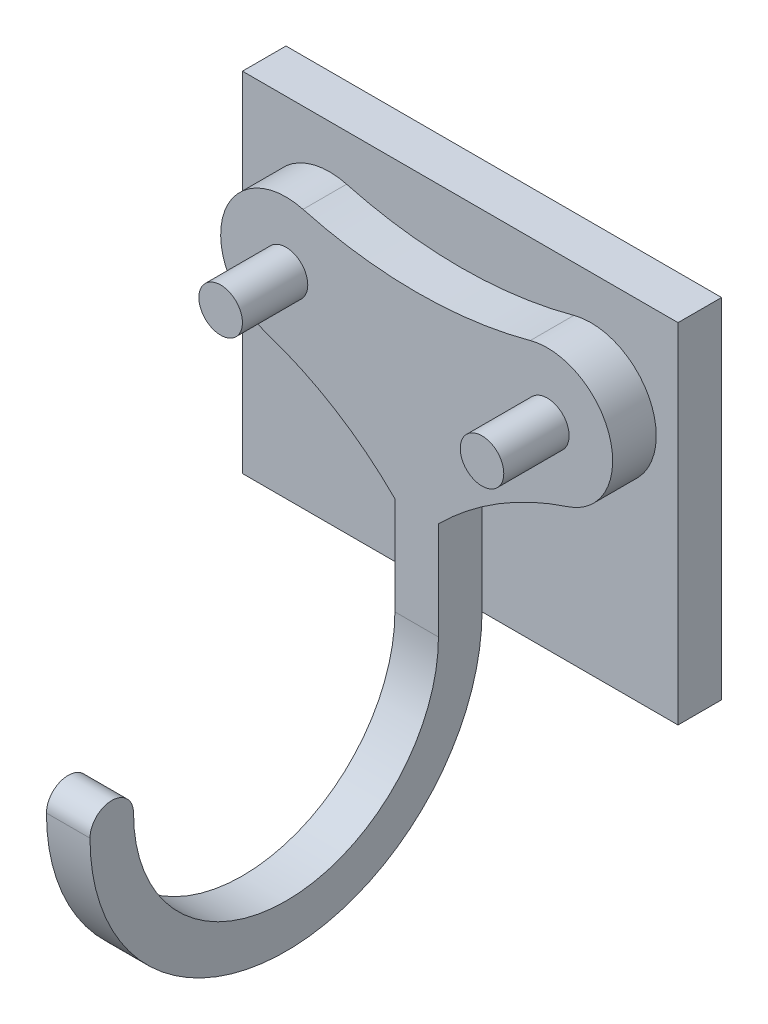
ISO-10303-21;
HEADER;
FILE_DESCRIPTION(('STEP AP214'),'2;1');
FILE_NAME('part.step','',(''),(''),'','','');
FILE_SCHEMA(('AUTOMOTIVE_DESIGN { 1 0 10303 214 1 1 1 1 }'));
ENDSEC;
DATA;
#1=APPLICATION_CONTEXT('core data for automotive mechanical design processes');
#2=APPLICATION_PROTOCOL_DEFINITION('international standard','automotive_design',2000,#1);
#3=PRODUCT_CONTEXT('',#1,'mechanical');
#4=PRODUCT('Part','Part','',(#3));
#5=PRODUCT_RELATED_PRODUCT_CATEGORY('part','',(#4));
#6=PRODUCT_DEFINITION_FORMATION('','',#4);
#7=PRODUCT_DEFINITION_CONTEXT('part definition',#1,'design');
#8=PRODUCT_DEFINITION('design','',#6,#7);
#9=PRODUCT_DEFINITION_SHAPE('','',#8);
#10=(LENGTH_UNIT() NAMED_UNIT(*) SI_UNIT(.MILLI.,.METRE.));
#11=(NAMED_UNIT(*) PLANE_ANGLE_UNIT() SI_UNIT($,.RADIAN.));
#12=(NAMED_UNIT(*) SI_UNIT($,.STERADIAN.) SOLID_ANGLE_UNIT());
#13=UNCERTAINTY_MEASURE_WITH_UNIT(LENGTH_MEASURE(1.E-05),#10,'distance_accuracy_value','');
#14=(GEOMETRIC_REPRESENTATION_CONTEXT(3) GLOBAL_UNCERTAINTY_ASSIGNED_CONTEXT((#13)) GLOBAL_UNIT_ASSIGNED_CONTEXT((#10,
#11,#12)) REPRESENTATION_CONTEXT('',''));
#15=CARTESIAN_POINT('',(0.,0.,0.));
#16=DIRECTION('',(0.,0.,1.));
#17=DIRECTION('',(1.,0.,0.));
#18=AXIS2_PLACEMENT_3D('',#15,#16,#17);
#19=CARTESIAN_POINT('',(-10.,8.,2.));
#20=DIRECTION('',(1.,0.,0.));
#21=DIRECTION('',(0.,0.,-1.));
#22=AXIS2_PLACEMENT_3D('',#19,#20,#21);
#23=PLANE('',#22);
#24=DIRECTION('',(0.,-1.,0.));
#25=VECTOR('',#24,1.);
#26=CARTESIAN_POINT('',(-10.,8.,0.));
#27=LINE('',#26,#25);
#28=CARTESIAN_POINT('',(-10.,8.,0.));
#29=VERTEX_POINT('',#28);
#30=CARTESIAN_POINT('',(-10.,-8.,0.));
#31=VERTEX_POINT('',#30);
#32=EDGE_CURVE('E279',#29,#31,#27,.T.);
#33=ORIENTED_EDGE('',*,*,#32,.T.);
#34=DIRECTION('',(0.,0.,-1.));
#35=VECTOR('',#34,1.);
#36=CARTESIAN_POINT('',(-10.,-8.,2.));
#37=LINE('',#36,#35);
#38=CARTESIAN_POINT('',(-10.,-8.,2.));
#39=VERTEX_POINT('',#38);
#40=EDGE_CURVE('E11',#39,#31,#37,.T.);
#41=ORIENTED_EDGE('',*,*,#40,.F.);
#42=DIRECTION('',(0.,-1.,0.));
#43=VECTOR('',#42,1.);
#44=CARTESIAN_POINT('',(-10.,8.,2.));
#45=LINE('',#44,#43);
#46=CARTESIAN_POINT('',(-10.,8.,2.));
#47=VERTEX_POINT('',#46);
#48=EDGE_CURVE('E280',#47,#39,#45,.T.);
#49=ORIENTED_EDGE('',*,*,#48,.F.);
#50=DIRECTION('',(0.,0.,-1.));
#51=VECTOR('',#50,1.);
#52=CARTESIAN_POINT('',(-10.,8.,2.));
#53=LINE('',#52,#51);
#54=EDGE_CURVE('E298',#47,#29,#53,.T.);
#55=ORIENTED_EDGE('',*,*,#54,.T.);
#56=EDGE_LOOP('',(#33,#41,#49,#55));
#57=FACE_BOUND('',#56,.T.);
#58=ADVANCED_FACE('F45',(#57),#23,.F.);
#59=CARTESIAN_POINT('',(-10.,-8.,2.));
#60=DIRECTION('',(0.,1.,0.));
#61=DIRECTION('',(0.,0.,1.));
#62=AXIS2_PLACEMENT_3D('',#59,#60,#61);
#63=PLANE('',#62);
#64=DIRECTION('',(1.,0.,0.));
#65=VECTOR('',#64,1.);
#66=CARTESIAN_POINT('',(-10.,-8.,2.));
#67=LINE('',#66,#65);
#68=CARTESIAN_POINT('',(1.,-8.,2.));
#69=VERTEX_POINT('',#68);
#70=CARTESIAN_POINT('',(10.,-8.,2.));
#71=VERTEX_POINT('',#70);
#72=EDGE_CURVE('E284',#69,#71,#67,.T.);
#73=ORIENTED_EDGE('',*,*,#72,.F.);
#74=DIRECTION('',(-1.,0.,0.));
#75=VECTOR('',#74,1.);
#76=CARTESIAN_POINT('',(1.,-8.,2.));
#77=LINE('',#76,#75);
#78=CARTESIAN_POINT('',(-1.,-8.,2.));
#79=VERTEX_POINT('',#78);
#80=EDGE_CURVE('E156',#69,#79,#77,.T.);
#81=ORIENTED_EDGE('',*,*,#80,.T.);
#82=EDGE_CURVE('E286',#39,#79,#67,.T.);
#83=ORIENTED_EDGE('',*,*,#82,.F.);
#84=ORIENTED_EDGE('',*,*,#40,.T.);
#85=DIRECTION('',(1.,0.,0.));
#86=VECTOR('',#85,1.);
#87=CARTESIAN_POINT('',(-10.,-8.,0.));
#88=LINE('',#87,#86);
#89=CARTESIAN_POINT('',(10.,-8.,0.));
#90=VERTEX_POINT('',#89);
#91=EDGE_CURVE('E302',#31,#90,#88,.T.);
#92=ORIENTED_EDGE('',*,*,#91,.T.);
#93=DIRECTION('',(0.,0.,-1.));
#94=VECTOR('',#93,1.);
#95=CARTESIAN_POINT('',(10.,-8.,2.));
#96=LINE('',#95,#94);
#97=EDGE_CURVE('E53',#71,#90,#96,.T.);
#98=ORIENTED_EDGE('',*,*,#97,.F.);
#99=EDGE_LOOP('',(#73,#81,#83,#84,#92,#98));
#100=FACE_BOUND('',#99,.T.);
#101=ADVANCED_FACE('F325',(#100),#63,.F.);
#102=CARTESIAN_POINT('',(10.,8.,2.));
#103=DIRECTION('',(1.,0.,0.));
#104=DIRECTION('',(0.,1.,0.));
#105=AXIS2_PLACEMENT_3D('',#102,#103,#104);
#106=PLANE('',#105);
#107=DIRECTION('',(0.,-1.,0.));
#108=VECTOR('',#107,1.);
#109=CARTESIAN_POINT('',(10.,8.,0.));
#110=LINE('',#109,#108);
#111=CARTESIAN_POINT('',(10.,8.,0.));
#112=VERTEX_POINT('',#111);
#113=EDGE_CURVE('E306',#112,#90,#110,.T.);
#114=ORIENTED_EDGE('',*,*,#113,.F.);
#115=DIRECTION('',(0.,0.,-1.));
#116=VECTOR('',#115,1.);
#117=CARTESIAN_POINT('',(10.,8.,2.));
#118=LINE('',#117,#116);
#119=CARTESIAN_POINT('',(10.,8.,2.));
#120=VERTEX_POINT('',#119);
#121=EDGE_CURVE('E315',#120,#112,#118,.T.);
#122=ORIENTED_EDGE('',*,*,#121,.F.);
#123=DIRECTION('',(0.,-1.,0.));
#124=VECTOR('',#123,1.);
#125=CARTESIAN_POINT('',(10.,8.,2.));
#126=LINE('',#125,#124);
#127=EDGE_CURVE('E290',#120,#71,#126,.T.);
#128=ORIENTED_EDGE('',*,*,#127,.T.);
#129=ORIENTED_EDGE('',*,*,#97,.T.);
#130=EDGE_LOOP('',(#114,#122,#128,#129));
#131=FACE_BOUND('',#130,.T.);
#132=ADVANCED_FACE('F321',(#131),#106,.T.);
#133=CARTESIAN_POINT('',(-10.,8.,2.));
#134=DIRECTION('',(0.,1.,0.));
#135=DIRECTION('',(0.,0.,1.));
#136=AXIS2_PLACEMENT_3D('',#133,#134,#135);
#137=PLANE('',#136);
#138=DIRECTION('',(1.,0.,0.));
#139=VECTOR('',#138,1.);
#140=CARTESIAN_POINT('',(-10.,8.,0.));
#141=LINE('',#140,#139);
#142=EDGE_CURVE('E285',#29,#112,#141,.T.);
#143=ORIENTED_EDGE('',*,*,#142,.F.);
#144=ORIENTED_EDGE('',*,*,#54,.F.);
#145=DIRECTION('',(1.,0.,0.));
#146=VECTOR('',#145,1.);
#147=CARTESIAN_POINT('',(-10.,8.,2.));
#148=LINE('',#147,#146);
#149=EDGE_CURVE('E294',#47,#120,#148,.T.);
#150=ORIENTED_EDGE('',*,*,#149,.T.);
#151=ORIENTED_EDGE('',*,*,#121,.T.);
#152=EDGE_LOOP('',(#143,#144,#150,#151));
#153=FACE_BOUND('',#152,.T.);
#154=ADVANCED_FACE('F332',(#153),#137,.T.);
#155=CARTESIAN_POINT('',(0.,0.,2.));
#156=DIRECTION('',(0.,0.,1.));
#157=DIRECTION('',(1.,0.,0.));
#158=AXIS2_PLACEMENT_3D('',#155,#156,#157);
#159=PLANE('',#158);
#160=DIRECTION('',(0.,1.,0.));
#161=VECTOR('',#160,1.);
#162=CARTESIAN_POINT('',(1.,-3.5,2.));
#163=LINE('',#162,#161);
#164=CARTESIAN_POINT('',(1.,-3.5,2.));
#165=VERTEX_POINT('',#164);
#166=EDGE_CURVE('E249',#69,#165,#163,.T.);
#167=ORIENTED_EDGE('',*,*,#166,.F.);
#168=ORIENTED_EDGE('',*,*,#72,.T.);
#169=ORIENTED_EDGE('',*,*,#127,.F.);
#170=ORIENTED_EDGE('',*,*,#149,.F.);
#171=ORIENTED_EDGE('',*,*,#48,.T.);
#172=ORIENTED_EDGE('',*,*,#82,.T.);
#173=DIRECTION('',(0.,-1.,0.));
#174=VECTOR('',#173,1.);
#175=CARTESIAN_POINT('',(-1.,-3.5,2.));
#176=LINE('',#175,#174);
#177=CARTESIAN_POINT('',(-1.,-3.5,2.));
#178=VERTEX_POINT('',#177);
#179=EDGE_CURVE('E245',#178,#79,#176,.T.);
#180=ORIENTED_EDGE('',*,*,#179,.F.);
#181=CARTESIAN_POINT('',(-11.6096362336248,-14.1035663335576,2.));
#182=DIRECTION('',(0.,0.,-1.));
#183=DIRECTION('',(1.,0.,0.));
#184=AXIS2_PLACEMENT_3D('',#181,#182,#183);
#185=CIRCLE('',#184,15.);
#186=CARTESIAN_POINT('',(-6.93493937227081,0.149405611073742,2.));
#187=VERTEX_POINT('',#186);
#188=EDGE_CURVE('E241',#187,#178,#185,.T.);
#189=ORIENTED_EDGE('',*,*,#188,.F.);
#190=CARTESIAN_POINT('',(-6.,3.,2.));
#191=DIRECTION('',(0.,0.,1.));
#192=DIRECTION('',(1.,0.,0.));
#193=AXIS2_PLACEMENT_3D('',#190,#191,#192);
#194=CIRCLE('',#193,3.);
#195=CARTESIAN_POINT('',(-5.21739130434783,5.89612217102276,2.));
#196=VERTEX_POINT('',#195);
#197=EDGE_CURVE('E237',#196,#187,#194,.T.);
#198=ORIENTED_EDGE('',*,*,#197,.F.);
#199=CARTESIAN_POINT('',(0.,25.2036033111745,2.));
#200=DIRECTION('',(0.,0.,-1.));
#201=DIRECTION('',(1.,0.,0.));
#202=AXIS2_PLACEMENT_3D('',#199,#200,#201);
#203=CIRCLE('',#202,20.);
#204=CARTESIAN_POINT('',(5.21739130434783,5.89612217102276,2.));
#205=VERTEX_POINT('',#204);
#206=EDGE_CURVE('E196',#205,#196,#203,.T.);
#207=ORIENTED_EDGE('',*,*,#206,.F.);
#208=CARTESIAN_POINT('',(6.,3.,2.));
#209=DIRECTION('',(0.,0.,1.));
#210=DIRECTION('',(1.,0.,0.));
#211=AXIS2_PLACEMENT_3D('',#208,#209,#210);
#212=CIRCLE('',#211,3.);
#213=CARTESIAN_POINT('',(6.9349393722708,0.149405611073742,2.));
#214=VERTEX_POINT('',#213);
#215=EDGE_CURVE('E65',#214,#205,#212,.T.);
#216=ORIENTED_EDGE('',*,*,#215,.F.);
#217=CARTESIAN_POINT('',(11.6096362336248,-14.1035663335576,2.));
#218=DIRECTION('',(0.,0.,-1.));
#219=DIRECTION('',(1.,0.,0.));
#220=AXIS2_PLACEMENT_3D('',#217,#218,#219);
#221=CIRCLE('',#220,15.);
#222=EDGE_CURVE('E60',#165,#214,#221,.T.);
#223=ORIENTED_EDGE('',*,*,#222,.F.);
#224=EDGE_LOOP('',(#167,#168,#169,#170,#171,#172,#180,#189,#198,#207,#216,#223));
#225=FACE_BOUND('',#224,.T.);
#226=ADVANCED_FACE('F335',(#225),#159,.T.);
#227=CARTESIAN_POINT('',(0.,0.,0.));
#228=DIRECTION('',(0.,0.,1.));
#229=DIRECTION('',(1.,0.,0.));
#230=AXIS2_PLACEMENT_3D('',#227,#228,#229);
#231=PLANE('',#230);
#232=ORIENTED_EDGE('',*,*,#32,.F.);
#233=ORIENTED_EDGE('',*,*,#142,.T.);
#234=ORIENTED_EDGE('',*,*,#113,.T.);
#235=ORIENTED_EDGE('',*,*,#91,.F.);
#236=EDGE_LOOP('',(#232,#233,#234,#235));
#237=FACE_BOUND('',#236,.T.);
#238=ADVANCED_FACE('F329',(#237),#231,.F.);
#239=CARTESIAN_POINT('',(0.,25.2036033111745,4.));
#240=DIRECTION('',(0.,0.,-1.));
#241=DIRECTION('',(-1.,0.,0.));
#242=AXIS2_PLACEMENT_3D('',#239,#240,#241);
#243=CYLINDRICAL_SURFACE('',#242,20.);
#244=ORIENTED_EDGE('',*,*,#206,.T.);
#245=DIRECTION('',(0.,0.,-1.));
#246=VECTOR('',#245,1.);
#247=CARTESIAN_POINT('',(-5.21739130434783,5.89612217102276,4.));
#248=LINE('',#247,#246);
#249=CARTESIAN_POINT('',(-5.21739130434783,5.89612217102276,4.));
#250=VERTEX_POINT('',#249);
#251=EDGE_CURVE('E275',#250,#196,#248,.T.);
#252=ORIENTED_EDGE('',*,*,#251,.F.);
#253=CARTESIAN_POINT('',(0.,25.2036033111745,4.));
#254=DIRECTION('',(0.,0.,-1.));
#255=DIRECTION('',(1.,0.,0.));
#256=AXIS2_PLACEMENT_3D('',#253,#254,#255);
#257=CIRCLE('',#256,20.);
#258=CARTESIAN_POINT('',(5.21739130434783,5.89612217102276,4.));
#259=VERTEX_POINT('',#258);
#260=EDGE_CURVE('E208',#259,#250,#257,.T.);
#261=ORIENTED_EDGE('',*,*,#260,.F.);
#262=DIRECTION('',(0.,0.,-1.));
#263=VECTOR('',#262,1.);
#264=CARTESIAN_POINT('',(5.21739130434783,5.89612217102276,4.));
#265=LINE('',#264,#263);
#266=EDGE_CURVE('E233',#259,#205,#265,.T.);
#267=ORIENTED_EDGE('',*,*,#266,.T.);
#268=EDGE_LOOP('',(#244,#252,#261,#267));
#269=FACE_BOUND('',#268,.T.);
#270=ADVANCED_FACE('F351',(#269),#243,.F.);
#271=CARTESIAN_POINT('',(-6.,3.,4.));
#272=DIRECTION('',(0.,0.,-1.));
#273=DIRECTION('',(-1.,0.,0.));
#274=AXIS2_PLACEMENT_3D('',#271,#272,#273);
#275=CYLINDRICAL_SURFACE('',#274,3.);
#276=ORIENTED_EDGE('',*,*,#197,.T.);
#277=DIRECTION('',(0.,0.,-1.));
#278=VECTOR('',#277,1.);
#279=CARTESIAN_POINT('',(-6.93493937227081,0.149405611073742,4.));
#280=LINE('',#279,#278);
#281=CARTESIAN_POINT('',(-6.93493937227081,0.149405611073742,4.));
#282=VERTEX_POINT('',#281);
#283=EDGE_CURVE('E271',#282,#187,#280,.T.);
#284=ORIENTED_EDGE('',*,*,#283,.F.);
#285=CARTESIAN_POINT('',(-6.,3.,4.));
#286=DIRECTION('',(0.,0.,1.));
#287=DIRECTION('',(1.,0.,0.));
#288=AXIS2_PLACEMENT_3D('',#285,#286,#287);
#289=CIRCLE('',#288,3.);
#290=EDGE_CURVE('E212',#250,#282,#289,.T.);
#291=ORIENTED_EDGE('',*,*,#290,.F.);
#292=ORIENTED_EDGE('',*,*,#251,.T.);
#293=EDGE_LOOP('',(#276,#284,#291,#292));
#294=FACE_BOUND('',#293,.T.);
#295=ADVANCED_FACE('F347',(#294),#275,.T.);
#296=CARTESIAN_POINT('',(-11.6096362336248,-14.1035663335576,4.));
#297=DIRECTION('',(0.,0.,-1.));
#298=DIRECTION('',(-1.,0.,0.));
#299=AXIS2_PLACEMENT_3D('',#296,#297,#298);
#300=CYLINDRICAL_SURFACE('',#299,15.);
#301=ORIENTED_EDGE('',*,*,#188,.T.);
#302=DIRECTION('',(0.,0.,-1.));
#303=VECTOR('',#302,1.);
#304=CARTESIAN_POINT('',(-1.,-3.5,4.));
#305=LINE('',#304,#303);
#306=CARTESIAN_POINT('',(-1.,-3.5,4.));
#307=VERTEX_POINT('',#306);
#308=EDGE_CURVE('E267',#307,#178,#305,.T.);
#309=ORIENTED_EDGE('',*,*,#308,.F.);
#310=CARTESIAN_POINT('',(-11.6096362336248,-14.1035663335576,4.));
#311=DIRECTION('',(0.,0.,-1.));
#312=DIRECTION('',(1.,0.,0.));
#313=AXIS2_PLACEMENT_3D('',#310,#311,#312);
#314=CIRCLE('',#313,15.);
#315=EDGE_CURVE('E215',#282,#307,#314,.T.);
#316=ORIENTED_EDGE('',*,*,#315,.F.);
#317=ORIENTED_EDGE('',*,*,#283,.T.);
#318=EDGE_LOOP('',(#301,#309,#316,#317));
#319=FACE_BOUND('',#318,.T.);
#320=ADVANCED_FACE('F344',(#319),#300,.F.);
#321=CARTESIAN_POINT('',(-1.,-3.5,4.));
#322=DIRECTION('',(1.,0.,0.));
#323=DIRECTION('',(0.,1.,0.));
#324=AXIS2_PLACEMENT_3D('',#321,#322,#323);
#325=PLANE('',#324);
#326=ORIENTED_EDGE('',*,*,#179,.T.);
#327=CARTESIAN_POINT('',(-1.,-8.,11.));
#328=DIRECTION('',(-1.,0.,0.));
#329=DIRECTION('',(0.,-1.,0.));
#330=AXIS2_PLACEMENT_3D('',#327,#328,#329);
#331=CIRCLE('',#330,9.);
#332=CARTESIAN_POINT('',(-1.,-8.,20.));
#333=VERTEX_POINT('',#332);
#334=EDGE_CURVE('E173',#79,#333,#331,.T.);
#335=ORIENTED_EDGE('',*,*,#334,.T.);
#336=CARTESIAN_POINT('',(-1.,-8.,19.));
#337=DIRECTION('',(-1.,0.,0.));
#338=DIRECTION('',(0.,-1.,0.));
#339=AXIS2_PLACEMENT_3D('',#336,#337,#338);
#340=CIRCLE('',#339,1.);
#341=CARTESIAN_POINT('',(-1.,-8.,18.));
#342=VERTEX_POINT('',#341);
#343=EDGE_CURVE('E181',#333,#342,#340,.T.);
#344=ORIENTED_EDGE('',*,*,#343,.T.);
#345=CARTESIAN_POINT('',(-1.,-8.,11.));
#346=DIRECTION('',(1.,0.,0.));
#347=DIRECTION('',(0.,-1.,0.));
#348=AXIS2_PLACEMENT_3D('',#345,#346,#347);
#349=CIRCLE('',#348,7.);
#350=CARTESIAN_POINT('',(-1.,-8.,4.));
#351=VERTEX_POINT('',#350);
#352=EDGE_CURVE('E150',#342,#351,#349,.T.);
#353=ORIENTED_EDGE('',*,*,#352,.T.);
#354=DIRECTION('',(0.,-1.,0.));
#355=VECTOR('',#354,1.);
#356=CARTESIAN_POINT('',(-1.,-3.5,4.));
#357=LINE('',#356,#355);
#358=EDGE_CURVE('E218',#307,#351,#357,.T.);
#359=ORIENTED_EDGE('',*,*,#358,.F.);
#360=ORIENTED_EDGE('',*,*,#308,.T.);
#361=EDGE_LOOP('',(#326,#335,#344,#353,#359,#360));
#362=FACE_BOUND('',#361,.T.);
#363=ADVANCED_FACE('F339',(#362),#325,.F.);
#364=CARTESIAN_POINT('',(1.,-3.5,4.));
#365=DIRECTION('',(-1.,0.,0.));
#366=DIRECTION('',(0.,-1.,0.));
#367=AXIS2_PLACEMENT_3D('',#364,#365,#366);
#368=PLANE('',#367);
#369=ORIENTED_EDGE('',*,*,#166,.T.);
#370=DIRECTION('',(0.,0.,-1.));
#371=VECTOR('',#370,1.);
#372=CARTESIAN_POINT('',(1.,-3.5,4.));
#373=LINE('',#372,#371);
#374=CARTESIAN_POINT('',(1.,-3.5,4.));
#375=VERTEX_POINT('',#374);
#376=EDGE_CURVE('E263',#375,#165,#373,.T.);
#377=ORIENTED_EDGE('',*,*,#376,.F.);
#378=DIRECTION('',(0.,1.,0.));
#379=VECTOR('',#378,1.);
#380=CARTESIAN_POINT('',(1.,-3.5,4.));
#381=LINE('',#380,#379);
#382=CARTESIAN_POINT('',(1.,-8.,4.));
#383=VERTEX_POINT('',#382);
#384=EDGE_CURVE('E167',#383,#375,#381,.T.);
#385=ORIENTED_EDGE('',*,*,#384,.F.);
#386=CARTESIAN_POINT('',(1.,-8.,11.));
#387=DIRECTION('',(1.,0.,0.));
#388=DIRECTION('',(0.,-1.,0.));
#389=AXIS2_PLACEMENT_3D('',#386,#387,#388);
#390=CIRCLE('',#389,7.);
#391=CARTESIAN_POINT('',(1.,-8.,18.));
#392=VERTEX_POINT('',#391);
#393=EDGE_CURVE('E147',#392,#383,#390,.T.);
#394=ORIENTED_EDGE('',*,*,#393,.F.);
#395=CARTESIAN_POINT('',(1.,-8.,19.));
#396=DIRECTION('',(-1.,0.,0.));
#397=DIRECTION('',(0.,-1.,0.));
#398=AXIS2_PLACEMENT_3D('',#395,#396,#397);
#399=CIRCLE('',#398,1.);
#400=CARTESIAN_POINT('',(1.,-8.,20.));
#401=VERTEX_POINT('',#400);
#402=EDGE_CURVE('E164',#401,#392,#399,.T.);
#403=ORIENTED_EDGE('',*,*,#402,.F.);
#404=CARTESIAN_POINT('',(1.,-8.,11.));
#405=DIRECTION('',(-1.,0.,0.));
#406=DIRECTION('',(0.,-1.,0.));
#407=AXIS2_PLACEMENT_3D('',#404,#405,#406);
#408=CIRCLE('',#407,9.);
#409=EDGE_CURVE('E157',#69,#401,#408,.T.);
#410=ORIENTED_EDGE('',*,*,#409,.F.);
#411=EDGE_LOOP('',(#369,#377,#385,#394,#403,#410));
#412=FACE_BOUND('',#411,.T.);
#413=ADVANCED_FACE('F162',(#412),#368,.F.);
#414=CARTESIAN_POINT('',(11.6096362336248,-14.1035663335576,4.));
#415=DIRECTION('',(0.,0.,-1.));
#416=DIRECTION('',(-1.,0.,0.));
#417=AXIS2_PLACEMENT_3D('',#414,#415,#416);
#418=CYLINDRICAL_SURFACE('',#417,15.);
#419=ORIENTED_EDGE('',*,*,#222,.T.);
#420=DIRECTION('',(0.,0.,-1.));
#421=VECTOR('',#420,1.);
#422=CARTESIAN_POINT('',(6.9349393722708,0.149405611073742,4.));
#423=LINE('',#422,#421);
#424=CARTESIAN_POINT('',(6.9349393722708,0.149405611073742,4.));
#425=VERTEX_POINT('',#424);
#426=EDGE_CURVE('E259',#425,#214,#423,.T.);
#427=ORIENTED_EDGE('',*,*,#426,.F.);
#428=CARTESIAN_POINT('',(11.6096362336248,-14.1035663335576,4.));
#429=DIRECTION('',(0.,0.,-1.));
#430=DIRECTION('',(1.,0.,0.));
#431=AXIS2_PLACEMENT_3D('',#428,#429,#430);
#432=CIRCLE('',#431,15.);
#433=EDGE_CURVE('E227',#375,#425,#432,.T.);
#434=ORIENTED_EDGE('',*,*,#433,.F.);
#435=ORIENTED_EDGE('',*,*,#376,.T.);
#436=EDGE_LOOP('',(#419,#427,#434,#435));
#437=FACE_BOUND('',#436,.T.);
#438=ADVANCED_FACE('F359',(#437),#418,.F.);
#439=CARTESIAN_POINT('',(6.,3.,4.));
#440=DIRECTION('',(0.,0.,-1.));
#441=DIRECTION('',(-1.,0.,0.));
#442=AXIS2_PLACEMENT_3D('',#439,#440,#441);
#443=CYLINDRICAL_SURFACE('',#442,3.);
#444=ORIENTED_EDGE('',*,*,#215,.T.);
#445=ORIENTED_EDGE('',*,*,#266,.F.);
#446=CARTESIAN_POINT('',(6.,3.,4.));
#447=DIRECTION('',(0.,0.,1.));
#448=DIRECTION('',(1.,0.,0.));
#449=AXIS2_PLACEMENT_3D('',#446,#447,#448);
#450=CIRCLE('',#449,3.);
#451=EDGE_CURVE('E230',#425,#259,#450,.T.);
#452=ORIENTED_EDGE('',*,*,#451,.F.);
#453=ORIENTED_EDGE('',*,*,#426,.T.);
#454=EDGE_LOOP('',(#444,#445,#452,#453));
#455=FACE_BOUND('',#454,.T.);
#456=ADVANCED_FACE('F354',(#455),#443,.T.);
#457=CARTESIAN_POINT('',(0.,25.2036033111745,4.));
#458=DIRECTION('',(0.,0.,1.));
#459=DIRECTION('',(1.,0.,0.));
#460=AXIS2_PLACEMENT_3D('',#457,#458,#459);
#461=PLANE('',#460);
#462=CARTESIAN_POINT('',(-6.,3.,4.));
#463=DIRECTION('',(0.,0.,1.));
#464=DIRECTION('',(1.,0.,0.));
#465=AXIS2_PLACEMENT_3D('',#462,#463,#464);
#466=CIRCLE('',#465,1.);
#467=CARTESIAN_POINT('',(-5.,3.,4.));
#468=VERTEX_POINT('',#467);
#469=EDGE_CURVE('E197',#468,#468,#466,.T.);
#470=ORIENTED_EDGE('',*,*,#469,.F.);
#471=EDGE_LOOP('',(#470));
#472=FACE_BOUND('',#471,.T.);
#473=CARTESIAN_POINT('',(6.,3.,4.));
#474=DIRECTION('',(0.,0.,1.));
#475=DIRECTION('',(1.,0.,0.));
#476=AXIS2_PLACEMENT_3D('',#473,#474,#475);
#477=CIRCLE('',#476,1.);
#478=CARTESIAN_POINT('',(7.,3.,4.));
#479=VERTEX_POINT('',#478);
#480=EDGE_CURVE('E201',#479,#479,#477,.T.);
#481=ORIENTED_EDGE('',*,*,#480,.F.);
#482=EDGE_LOOP('',(#481));
#483=FACE_BOUND('',#482,.T.);
#484=ORIENTED_EDGE('',*,*,#260,.T.);
#485=ORIENTED_EDGE('',*,*,#290,.T.);
#486=ORIENTED_EDGE('',*,*,#315,.T.);
#487=ORIENTED_EDGE('',*,*,#358,.T.);
#488=DIRECTION('',(1.,0.,0.));
#489=VECTOR('',#488,1.);
#490=CARTESIAN_POINT('',(-1.,-8.,4.));
#491=LINE('',#490,#489);
#492=EDGE_CURVE('E222',#351,#383,#491,.T.);
#493=ORIENTED_EDGE('',*,*,#492,.T.);
#494=ORIENTED_EDGE('',*,*,#384,.T.);
#495=ORIENTED_EDGE('',*,*,#433,.T.);
#496=ORIENTED_EDGE('',*,*,#451,.T.);
#497=EDGE_LOOP('',(#484,#485,#486,#487,#493,#494,#495,#496));
#498=FACE_BOUND('',#497,.T.);
#499=ADVANCED_FACE('F362',(#472,#483,#498),#461,.T.);
#500=CARTESIAN_POINT('',(6.,3.,7.));
#501=DIRECTION('',(0.,0.,-1.));
#502=DIRECTION('',(-1.,0.,0.));
#503=AXIS2_PLACEMENT_3D('',#500,#501,#502);
#504=CYLINDRICAL_SURFACE('',#503,1.);
#505=CARTESIAN_POINT('',(6.,3.,7.));
#506=DIRECTION('',(0.,0.,1.));
#507=DIRECTION('',(1.,0.,0.));
#508=AXIS2_PLACEMENT_3D('',#505,#506,#507);
#509=CIRCLE('',#508,1.);
#510=CARTESIAN_POINT('',(7.,3.,7.));
#511=VERTEX_POINT('',#510);
#512=EDGE_CURVE('E188',#511,#511,#509,.T.);
#513=ORIENTED_EDGE('',*,*,#512,.F.);
#514=EDGE_LOOP('',(#513));
#515=FACE_BOUND('',#514,.T.);
#516=ORIENTED_EDGE('',*,*,#480,.T.);
#517=EDGE_LOOP('',(#516));
#518=FACE_BOUND('',#517,.T.);
#519=ADVANCED_FACE('F364',(#515,#518),#504,.T.);
#520=CARTESIAN_POINT('',(6.,3.,7.));
#521=DIRECTION('',(0.,0.,1.));
#522=DIRECTION('',(1.,0.,0.));
#523=AXIS2_PLACEMENT_3D('',#520,#521,#522);
#524=PLANE('',#523);
#525=ORIENTED_EDGE('',*,*,#512,.T.);
#526=EDGE_LOOP('',(#525));
#527=FACE_BOUND('',#526,.T.);
#528=ADVANCED_FACE('F372',(#527),#524,.T.);
#529=CARTESIAN_POINT('',(-6.,3.,7.));
#530=DIRECTION('',(0.,0.,-1.));
#531=DIRECTION('',(-1.,0.,0.));
#532=AXIS2_PLACEMENT_3D('',#529,#530,#531);
#533=CYLINDRICAL_SURFACE('',#532,1.);
#534=CARTESIAN_POINT('',(-6.,3.,7.));
#535=DIRECTION('',(0.,0.,1.));
#536=DIRECTION('',(1.,0.,0.));
#537=AXIS2_PLACEMENT_3D('',#534,#535,#536);
#538=CIRCLE('',#537,1.);
#539=CARTESIAN_POINT('',(-5.,3.,7.));
#540=VERTEX_POINT('',#539);
#541=EDGE_CURVE('E192',#540,#540,#538,.T.);
#542=ORIENTED_EDGE('',*,*,#541,.F.);
#543=EDGE_LOOP('',(#542));
#544=FACE_BOUND('',#543,.T.);
#545=ORIENTED_EDGE('',*,*,#469,.T.);
#546=EDGE_LOOP('',(#545));
#547=FACE_BOUND('',#546,.T.);
#548=ADVANCED_FACE('F429',(#544,#547),#533,.T.);
#549=CARTESIAN_POINT('',(-6.,3.,7.));
#550=DIRECTION('',(0.,0.,1.));
#551=DIRECTION('',(1.,0.,0.));
#552=AXIS2_PLACEMENT_3D('',#549,#550,#551);
#553=PLANE('',#552);
#554=ORIENTED_EDGE('',*,*,#541,.T.);
#555=EDGE_LOOP('',(#554));
#556=FACE_BOUND('',#555,.T.);
#557=ADVANCED_FACE('F436',(#556),#553,.T.);
#558=CARTESIAN_POINT('',(1.,-8.,19.));
#559=DIRECTION('',(-1.,0.,0.));
#560=DIRECTION('',(0.,-1.,0.));
#561=AXIS2_PLACEMENT_3D('',#558,#559,#560);
#562=CYLINDRICAL_SURFACE('',#561,1.);
#563=ORIENTED_EDGE('',*,*,#343,.F.);
#564=DIRECTION('',(-1.,0.,0.));
#565=VECTOR('',#564,1.);
#566=CARTESIAN_POINT('',(1.,-8.,20.));
#567=LINE('',#566,#565);
#568=EDGE_CURVE('E171',#401,#333,#567,.T.);
#569=ORIENTED_EDGE('',*,*,#568,.F.);
#570=ORIENTED_EDGE('',*,*,#402,.T.);
#571=DIRECTION('',(-1.,0.,0.));
#572=VECTOR('',#571,1.);
#573=CARTESIAN_POINT('',(1.,-8.,18.));
#574=LINE('',#573,#572);
#575=EDGE_CURVE('E144',#392,#342,#574,.T.);
#576=ORIENTED_EDGE('',*,*,#575,.T.);
#577=EDGE_LOOP('',(#563,#569,#570,#576));
#578=FACE_BOUND('',#577,.T.);
#579=ADVANCED_FACE('F170',(#578),#562,.T.);
#580=CARTESIAN_POINT('',(1.,-8.,11.));
#581=DIRECTION('',(-1.,0.,0.));
#582=DIRECTION('',(0.,-1.,0.));
#583=AXIS2_PLACEMENT_3D('',#580,#581,#582);
#584=CYLINDRICAL_SURFACE('',#583,9.);
#585=ORIENTED_EDGE('',*,*,#334,.F.);
#586=ORIENTED_EDGE('',*,*,#80,.F.);
#587=ORIENTED_EDGE('',*,*,#409,.T.);
#588=ORIENTED_EDGE('',*,*,#568,.T.);
#589=EDGE_LOOP('',(#585,#586,#587,#588));
#590=FACE_BOUND('',#589,.T.);
#591=ADVANCED_FACE('F360',(#590),#584,.T.);
#592=CARTESIAN_POINT('',(1.,-8.,11.));
#593=DIRECTION('',(-1.,0.,0.));
#594=DIRECTION('',(0.,-1.,0.));
#595=AXIS2_PLACEMENT_3D('',#592,#593,#594);
#596=CYLINDRICAL_SURFACE('',#595,7.);
#597=ORIENTED_EDGE('',*,*,#352,.F.);
#598=ORIENTED_EDGE('',*,*,#575,.F.);
#599=ORIENTED_EDGE('',*,*,#393,.T.);
#600=ORIENTED_EDGE('',*,*,#492,.F.);
#601=EDGE_LOOP('',(#597,#598,#599,#600));
#602=FACE_BOUND('',#601,.T.);
#603=ADVANCED_FACE('F146',(#602),#596,.F.);
#604=CLOSED_SHELL('',(#58,#101,#132,#154,#226,#238,#270,#295,#320,#363,#413,#438,#456,#499,#519,
#528,#548,#557,#579,#591,#603));
#605=MANIFOLD_SOLID_BREP('B2',#604);
#606=ADVANCED_BREP_SHAPE_REPRESENTATION('',(#18,#605),#14);
#607=SHAPE_DEFINITION_REPRESENTATION(#9,#606);
ENDSEC;
END-ISO-10303-21;
